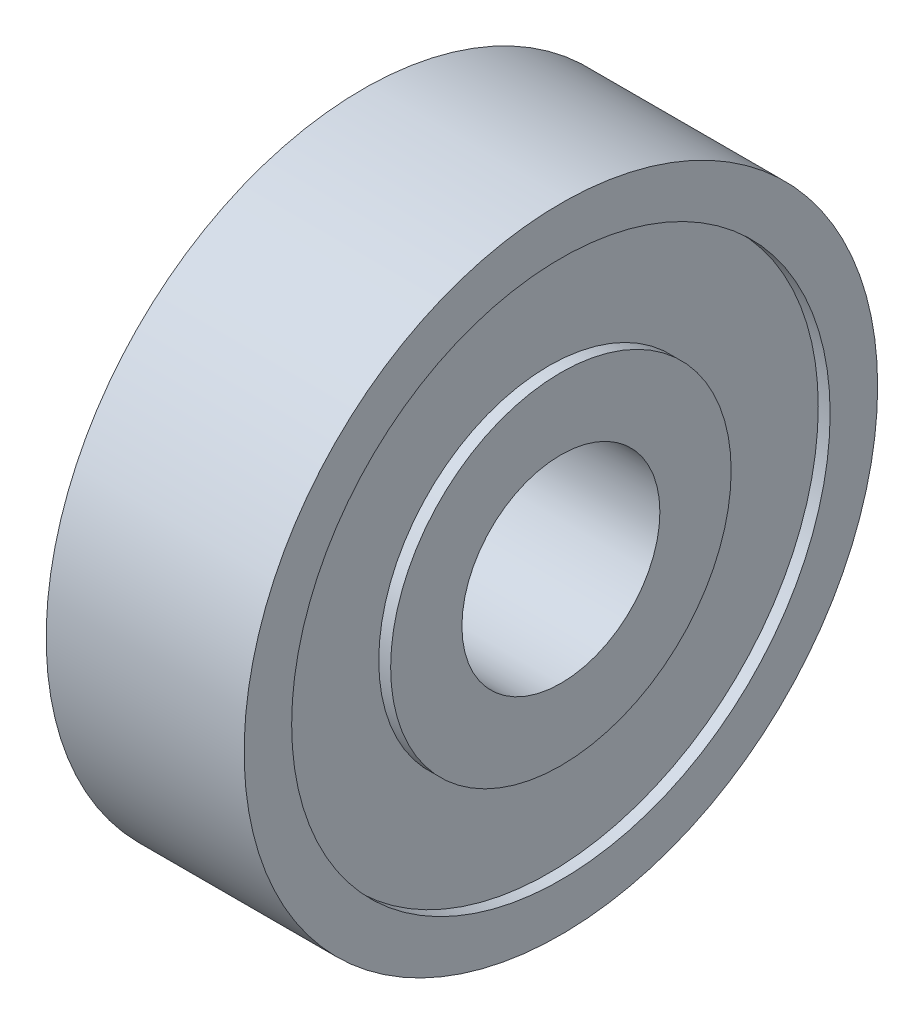
ISO-10303-21;
HEADER;
FILE_DESCRIPTION(('STEP AP214'),'2;1');
FILE_NAME('part.step','',(''),(''),'','','');
FILE_SCHEMA(('AUTOMOTIVE_DESIGN { 1 0 10303 214 1 1 1 1 }'));
ENDSEC;
DATA;
#1=APPLICATION_CONTEXT('core data for automotive mechanical design processes');
#2=APPLICATION_PROTOCOL_DEFINITION('international standard','automotive_design',2000,#1);
#3=PRODUCT_CONTEXT('',#1,'mechanical');
#4=PRODUCT('Part','Part','',(#3));
#5=PRODUCT_RELATED_PRODUCT_CATEGORY('part','',(#4));
#6=PRODUCT_DEFINITION_FORMATION('','',#4);
#7=PRODUCT_DEFINITION_CONTEXT('part definition',#1,'design');
#8=PRODUCT_DEFINITION('design','',#6,#7);
#9=PRODUCT_DEFINITION_SHAPE('','',#8);
#10=(LENGTH_UNIT() NAMED_UNIT(*) SI_UNIT(.MILLI.,.METRE.));
#11=(NAMED_UNIT(*) PLANE_ANGLE_UNIT() SI_UNIT($,.RADIAN.));
#12=(NAMED_UNIT(*) SI_UNIT($,.STERADIAN.) SOLID_ANGLE_UNIT());
#13=UNCERTAINTY_MEASURE_WITH_UNIT(LENGTH_MEASURE(1.E-05),#10,'distance_accuracy_value','');
#14=(GEOMETRIC_REPRESENTATION_CONTEXT(3) GLOBAL_UNCERTAINTY_ASSIGNED_CONTEXT((#13)) GLOBAL_UNIT_ASSIGNED_CONTEXT((#10,
#11,#12)) REPRESENTATION_CONTEXT('',''));
#15=CARTESIAN_POINT('',(0.,0.,0.));
#16=DIRECTION('',(0.,0.,1.));
#17=DIRECTION('',(1.,0.,0.));
#18=AXIS2_PLACEMENT_3D('',#15,#16,#17);
#19=CARTESIAN_POINT('',(-2.5,2.5,0.));
#20=DIRECTION('',(-1.,0.,0.));
#21=DIRECTION('',(0.,0.,1.));
#22=AXIS2_PLACEMENT_3D('',#19,#20,#21);
#23=PLANE('',#22);
#24=CARTESIAN_POINT('',(-2.5,0.,0.));
#25=DIRECTION('',(1.,0.,0.));
#26=DIRECTION('',(0.,0.,-1.));
#27=AXIS2_PLACEMENT_3D('',#24,#25,#26);
#28=CIRCLE('',#27,2.5);
#29=CARTESIAN_POINT('',(-2.5,0.,-2.5));
#30=VERTEX_POINT('',#29);
#31=EDGE_CURVE('E78',#30,#30,#28,.T.);
#32=ORIENTED_EDGE('',*,*,#31,.T.);
#33=EDGE_LOOP('',(#32));
#34=FACE_BOUND('',#33,.T.);
#35=CARTESIAN_POINT('',(-2.5,0.,0.));
#36=DIRECTION('',(1.,0.,0.));
#37=DIRECTION('',(0.,0.,-1.));
#38=AXIS2_PLACEMENT_3D('',#35,#36,#37);
#39=CIRCLE('',#38,4.3);
#40=CARTESIAN_POINT('',(-2.5,0.,-4.3));
#41=VERTEX_POINT('',#40);
#42=EDGE_CURVE('E10',#41,#41,#39,.T.);
#43=ORIENTED_EDGE('',*,*,#42,.F.);
#44=EDGE_LOOP('',(#43));
#45=FACE_BOUND('',#44,.T.);
#46=ADVANCED_FACE('F38',(#34,#45),#23,.T.);
#47=CARTESIAN_POINT('',(0.,0.,0.));
#48=DIRECTION('',(1.,0.,0.));
#49=DIRECTION('',(0.,0.,-1.));
#50=AXIS2_PLACEMENT_3D('',#47,#48,#49);
#51=CYLINDRICAL_SURFACE('',#50,4.3);
#52=ORIENTED_EDGE('',*,*,#42,.T.);
#53=EDGE_LOOP('',(#52));
#54=FACE_BOUND('',#53,.T.);
#55=CARTESIAN_POINT('',(-2.2,0.,0.));
#56=DIRECTION('',(1.,0.,0.));
#57=DIRECTION('',(0.,0.,-1.));
#58=AXIS2_PLACEMENT_3D('',#55,#56,#57);
#59=CIRCLE('',#58,4.3);
#60=CARTESIAN_POINT('',(-2.2,0.,-4.3));
#61=VERTEX_POINT('',#60);
#62=EDGE_CURVE('E44',#61,#61,#59,.T.);
#63=ORIENTED_EDGE('',*,*,#62,.F.);
#64=EDGE_LOOP('',(#63));
#65=FACE_BOUND('',#64,.T.);
#66=ADVANCED_FACE('F96',(#54,#65),#51,.T.);
#67=CARTESIAN_POINT('',(-2.2,4.3,0.));
#68=DIRECTION('',(-1.,0.,0.));
#69=DIRECTION('',(0.,0.,1.));
#70=AXIS2_PLACEMENT_3D('',#67,#68,#69);
#71=PLANE('',#70);
#72=ORIENTED_EDGE('',*,*,#62,.T.);
#73=EDGE_LOOP('',(#72));
#74=FACE_BOUND('',#73,.T.);
#75=CARTESIAN_POINT('',(-2.2,0.,0.));
#76=DIRECTION('',(1.,0.,0.));
#77=DIRECTION('',(0.,0.,-1.));
#78=AXIS2_PLACEMENT_3D('',#75,#76,#77);
#79=CIRCLE('',#78,6.8);
#80=CARTESIAN_POINT('',(-2.2,0.,-6.8));
#81=VERTEX_POINT('',#80);
#82=EDGE_CURVE('E48',#81,#81,#79,.T.);
#83=ORIENTED_EDGE('',*,*,#82,.F.);
#84=EDGE_LOOP('',(#83));
#85=FACE_BOUND('',#84,.T.);
#86=ADVANCED_FACE('F100',(#74,#85),#71,.T.);
#87=CARTESIAN_POINT('',(0.,0.,0.));
#88=DIRECTION('',(1.,0.,0.));
#89=DIRECTION('',(0.,0.,-1.));
#90=AXIS2_PLACEMENT_3D('',#87,#88,#89);
#91=CYLINDRICAL_SURFACE('',#90,6.8);
#92=ORIENTED_EDGE('',*,*,#82,.T.);
#93=EDGE_LOOP('',(#92));
#94=FACE_BOUND('',#93,.T.);
#95=CARTESIAN_POINT('',(-2.5,0.,0.));
#96=DIRECTION('',(1.,0.,0.));
#97=DIRECTION('',(0.,0.,-1.));
#98=AXIS2_PLACEMENT_3D('',#95,#96,#97);
#99=CIRCLE('',#98,6.8);
#100=CARTESIAN_POINT('',(-2.5,0.,-6.8));
#101=VERTEX_POINT('',#100);
#102=EDGE_CURVE('E52',#101,#101,#99,.T.);
#103=ORIENTED_EDGE('',*,*,#102,.F.);
#104=EDGE_LOOP('',(#103));
#105=FACE_BOUND('',#104,.T.);
#106=ADVANCED_FACE('F104',(#94,#105),#91,.F.);
#107=CARTESIAN_POINT('',(-2.5,6.8,0.));
#108=DIRECTION('',(-1.,0.,0.));
#109=DIRECTION('',(0.,0.,1.));
#110=AXIS2_PLACEMENT_3D('',#107,#108,#109);
#111=PLANE('',#110);
#112=ORIENTED_EDGE('',*,*,#102,.T.);
#113=EDGE_LOOP('',(#112));
#114=FACE_BOUND('',#113,.T.);
#115=CARTESIAN_POINT('',(-2.5,0.,0.));
#116=DIRECTION('',(1.,0.,0.));
#117=DIRECTION('',(0.,0.,-1.));
#118=AXIS2_PLACEMENT_3D('',#115,#116,#117);
#119=CIRCLE('',#118,8.);
#120=CARTESIAN_POINT('',(-2.5,0.,-8.));
#121=VERTEX_POINT('',#120);
#122=EDGE_CURVE('E57',#121,#121,#119,.T.);
#123=ORIENTED_EDGE('',*,*,#122,.F.);
#124=EDGE_LOOP('',(#123));
#125=FACE_BOUND('',#124,.T.);
#126=ADVANCED_FACE('F110',(#114,#125),#111,.T.);
#127=CARTESIAN_POINT('',(0.,0.,0.));
#128=DIRECTION('',(1.,0.,0.));
#129=DIRECTION('',(0.,0.,-1.));
#130=AXIS2_PLACEMENT_3D('',#127,#128,#129);
#131=CYLINDRICAL_SURFACE('',#130,8.);
#132=ORIENTED_EDGE('',*,*,#122,.T.);
#133=EDGE_LOOP('',(#132));
#134=FACE_BOUND('',#133,.T.);
#135=CARTESIAN_POINT('',(2.5,0.,0.));
#136=DIRECTION('',(1.,0.,0.));
#137=DIRECTION('',(0.,0.,-1.));
#138=AXIS2_PLACEMENT_3D('',#135,#136,#137);
#139=CIRCLE('',#138,8.);
#140=CARTESIAN_POINT('',(2.5,0.,-8.));
#141=VERTEX_POINT('',#140);
#142=EDGE_CURVE('E60',#141,#141,#139,.T.);
#143=ORIENTED_EDGE('',*,*,#142,.F.);
#144=EDGE_LOOP('',(#143));
#145=FACE_BOUND('',#144,.T.);
#146=ADVANCED_FACE('F114',(#134,#145),#131,.T.);
#147=CARTESIAN_POINT('',(2.5,6.8,0.));
#148=DIRECTION('',(1.,0.,0.));
#149=DIRECTION('',(0.,0.,-1.));
#150=AXIS2_PLACEMENT_3D('',#147,#148,#149);
#151=PLANE('',#150);
#152=ORIENTED_EDGE('',*,*,#142,.T.);
#153=EDGE_LOOP('',(#152));
#154=FACE_BOUND('',#153,.T.);
#155=CARTESIAN_POINT('',(2.5,0.,0.));
#156=DIRECTION('',(1.,0.,0.));
#157=DIRECTION('',(0.,0.,-1.));
#158=AXIS2_PLACEMENT_3D('',#155,#156,#157);
#159=CIRCLE('',#158,6.8);
#160=CARTESIAN_POINT('',(2.5,0.,-6.8));
#161=VERTEX_POINT('',#160);
#162=EDGE_CURVE('E63',#161,#161,#159,.T.);
#163=ORIENTED_EDGE('',*,*,#162,.F.);
#164=EDGE_LOOP('',(#163));
#165=FACE_BOUND('',#164,.T.);
#166=ADVANCED_FACE('F118',(#154,#165),#151,.T.);
#167=CARTESIAN_POINT('',(0.,0.,0.));
#168=DIRECTION('',(1.,0.,0.));
#169=DIRECTION('',(0.,0.,-1.));
#170=AXIS2_PLACEMENT_3D('',#167,#168,#169);
#171=CYLINDRICAL_SURFACE('',#170,6.8);
#172=ORIENTED_EDGE('',*,*,#162,.T.);
#173=EDGE_LOOP('',(#172));
#174=FACE_BOUND('',#173,.T.);
#175=CARTESIAN_POINT('',(2.2,0.,0.));
#176=DIRECTION('',(1.,0.,0.));
#177=DIRECTION('',(0.,0.,-1.));
#178=AXIS2_PLACEMENT_3D('',#175,#176,#177);
#179=CIRCLE('',#178,6.8);
#180=CARTESIAN_POINT('',(2.2,0.,-6.8));
#181=VERTEX_POINT('',#180);
#182=EDGE_CURVE('E66',#181,#181,#179,.T.);
#183=ORIENTED_EDGE('',*,*,#182,.F.);
#184=EDGE_LOOP('',(#183));
#185=FACE_BOUND('',#184,.T.);
#186=ADVANCED_FACE('F122',(#174,#185),#171,.F.);
#187=CARTESIAN_POINT('',(2.2,4.3,0.));
#188=DIRECTION('',(1.,0.,0.));
#189=DIRECTION('',(0.,0.,-1.));
#190=AXIS2_PLACEMENT_3D('',#187,#188,#189);
#191=PLANE('',#190);
#192=ORIENTED_EDGE('',*,*,#182,.T.);
#193=EDGE_LOOP('',(#192));
#194=FACE_BOUND('',#193,.T.);
#195=CARTESIAN_POINT('',(2.2,0.,0.));
#196=DIRECTION('',(1.,0.,0.));
#197=DIRECTION('',(0.,0.,-1.));
#198=AXIS2_PLACEMENT_3D('',#195,#196,#197);
#199=CIRCLE('',#198,4.3);
#200=CARTESIAN_POINT('',(2.2,0.,-4.3));
#201=VERTEX_POINT('',#200);
#202=EDGE_CURVE('E69',#201,#201,#199,.T.);
#203=ORIENTED_EDGE('',*,*,#202,.F.);
#204=EDGE_LOOP('',(#203));
#205=FACE_BOUND('',#204,.T.);
#206=ADVANCED_FACE('F126',(#194,#205),#191,.T.);
#207=CARTESIAN_POINT('',(0.,0.,0.));
#208=DIRECTION('',(1.,0.,0.));
#209=DIRECTION('',(0.,0.,-1.));
#210=AXIS2_PLACEMENT_3D('',#207,#208,#209);
#211=CYLINDRICAL_SURFACE('',#210,4.3);
#212=ORIENTED_EDGE('',*,*,#202,.T.);
#213=EDGE_LOOP('',(#212));
#214=FACE_BOUND('',#213,.T.);
#215=CARTESIAN_POINT('',(2.5,0.,0.));
#216=DIRECTION('',(1.,0.,0.));
#217=DIRECTION('',(0.,0.,-1.));
#218=AXIS2_PLACEMENT_3D('',#215,#216,#217);
#219=CIRCLE('',#218,4.3);
#220=CARTESIAN_POINT('',(2.5,0.,-4.3));
#221=VERTEX_POINT('',#220);
#222=EDGE_CURVE('E72',#221,#221,#219,.T.);
#223=ORIENTED_EDGE('',*,*,#222,.F.);
#224=EDGE_LOOP('',(#223));
#225=FACE_BOUND('',#224,.T.);
#226=ADVANCED_FACE('F92',(#214,#225),#211,.T.);
#227=CARTESIAN_POINT('',(2.5,2.5,0.));
#228=DIRECTION('',(1.,0.,0.));
#229=DIRECTION('',(0.,0.,-1.));
#230=AXIS2_PLACEMENT_3D('',#227,#228,#229);
#231=PLANE('',#230);
#232=ORIENTED_EDGE('',*,*,#222,.T.);
#233=EDGE_LOOP('',(#232));
#234=FACE_BOUND('',#233,.T.);
#235=CARTESIAN_POINT('',(2.5,0.,0.));
#236=DIRECTION('',(1.,0.,0.));
#237=DIRECTION('',(0.,0.,-1.));
#238=AXIS2_PLACEMENT_3D('',#235,#236,#237);
#239=CIRCLE('',#238,2.5);
#240=CARTESIAN_POINT('',(2.5,0.,-2.5));
#241=VERTEX_POINT('',#240);
#242=EDGE_CURVE('E75',#241,#241,#239,.T.);
#243=ORIENTED_EDGE('',*,*,#242,.F.);
#244=EDGE_LOOP('',(#243));
#245=FACE_BOUND('',#244,.T.);
#246=ADVANCED_FACE('F86',(#234,#245),#231,.T.);
#247=CARTESIAN_POINT('',(0.,0.,0.));
#248=DIRECTION('',(1.,0.,0.));
#249=DIRECTION('',(0.,0.,-1.));
#250=AXIS2_PLACEMENT_3D('',#247,#248,#249);
#251=CYLINDRICAL_SURFACE('',#250,2.5);
#252=ORIENTED_EDGE('',*,*,#242,.T.);
#253=EDGE_LOOP('',(#252));
#254=FACE_BOUND('',#253,.T.);
#255=ORIENTED_EDGE('',*,*,#31,.F.);
#256=EDGE_LOOP('',(#255));
#257=FACE_BOUND('',#256,.T.);
#258=ADVANCED_FACE('F84',(#254,#257),#251,.F.);
#259=CLOSED_SHELL('',(#46,#66,#86,#106,#126,#146,#166,#186,#206,#226,#246,#258));
#260=MANIFOLD_SOLID_BREP('B2',#259);
#261=ADVANCED_BREP_SHAPE_REPRESENTATION('',(#18,#260),#14);
#262=SHAPE_DEFINITION_REPRESENTATION(#9,#261);
ENDSEC;
END-ISO-10303-21;
